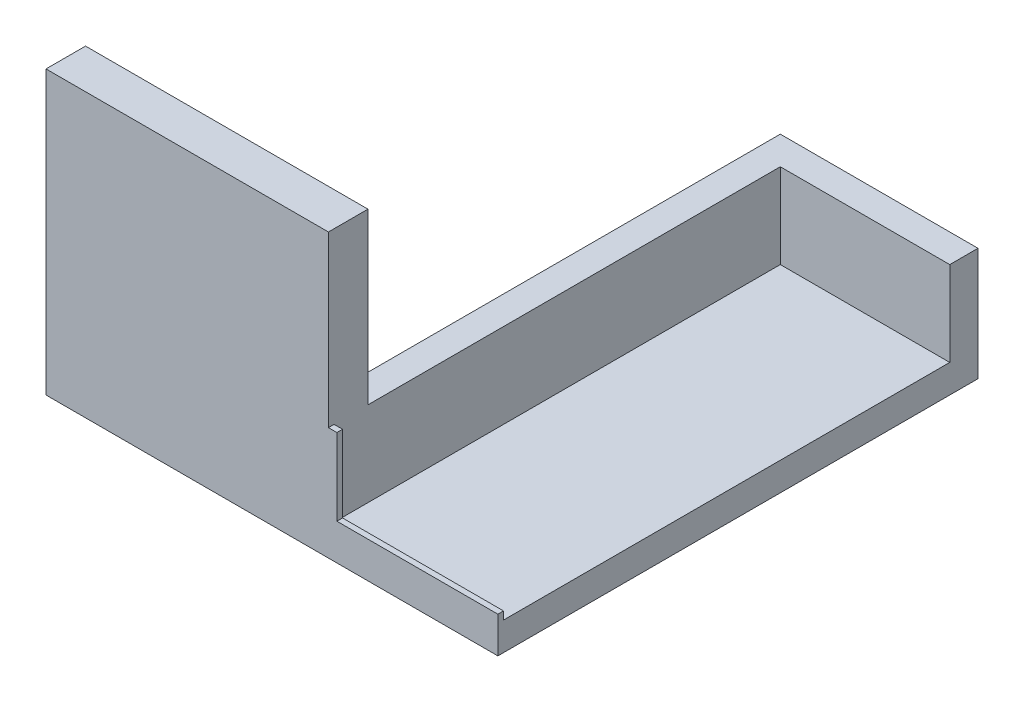
ISO-10303-21;
HEADER;
FILE_DESCRIPTION(('STEP AP214'),'2;1');
FILE_NAME('part.step','',(''),(''),'','','');
FILE_SCHEMA(('AUTOMOTIVE_DESIGN { 1 0 10303 214 1 1 1 1 }'));
ENDSEC;
DATA;
#1=APPLICATION_CONTEXT('core data for automotive mechanical design processes');
#2=APPLICATION_PROTOCOL_DEFINITION('international standard','automotive_design',2000,#1);
#3=PRODUCT_CONTEXT('',#1,'mechanical');
#4=PRODUCT('Part','Part','',(#3));
#5=PRODUCT_RELATED_PRODUCT_CATEGORY('part','',(#4));
#6=PRODUCT_DEFINITION_FORMATION('','',#4);
#7=PRODUCT_DEFINITION_CONTEXT('part definition',#1,'design');
#8=PRODUCT_DEFINITION('design','',#6,#7);
#9=PRODUCT_DEFINITION_SHAPE('','',#8);
#10=(LENGTH_UNIT() NAMED_UNIT(*) SI_UNIT(.MILLI.,.METRE.));
#11=(NAMED_UNIT(*) PLANE_ANGLE_UNIT() SI_UNIT($,.RADIAN.));
#12=(NAMED_UNIT(*) SI_UNIT($,.STERADIAN.) SOLID_ANGLE_UNIT());
#13=UNCERTAINTY_MEASURE_WITH_UNIT(LENGTH_MEASURE(1.E-05),#10,'distance_accuracy_value','');
#14=(GEOMETRIC_REPRESENTATION_CONTEXT(3) GLOBAL_UNCERTAINTY_ASSIGNED_CONTEXT((#13)) GLOBAL_UNIT_ASSIGNED_CONTEXT((#10,
#11,#12)) REPRESENTATION_CONTEXT('',''));
#15=CARTESIAN_POINT('',(0.,0.,0.));
#16=DIRECTION('',(0.,0.,1.));
#17=DIRECTION('',(1.,0.,0.));
#18=AXIS2_PLACEMENT_3D('',#15,#16,#17);
#19=CARTESIAN_POINT('',(0.,5.,0.));
#20=DIRECTION('',(0.,1.,0.));
#21=DIRECTION('',(0.,0.,1.));
#22=AXIS2_PLACEMENT_3D('',#19,#20,#21);
#23=PLANE('',#22);
#24=DIRECTION('',(0.,0.,1.));
#25=VECTOR('',#24,1.);
#26=CARTESIAN_POINT('',(-30.,5.,0.));
#27=LINE('',#26,#25);
#28=CARTESIAN_POINT('',(-30.,5.,-80.));
#29=VERTEX_POINT('',#28);
#30=CARTESIAN_POINT('',(-30.,5.,-1.));
#31=VERTEX_POINT('',#30);
#32=EDGE_CURVE('E74',#29,#31,#27,.T.);
#33=ORIENTED_EDGE('',*,*,#32,.T.);
#34=DIRECTION('',(-1.,0.,0.));
#35=VECTOR('',#34,1.);
#36=CARTESIAN_POINT('',(0.,5.,-1.));
#37=LINE('',#36,#35);
#38=CARTESIAN_POINT('',(0.,5.,-1.));
#39=VERTEX_POINT('',#38);
#40=EDGE_CURVE('E89',#39,#31,#37,.T.);
#41=ORIENTED_EDGE('',*,*,#40,.F.);
#42=DIRECTION('',(0.,0.,1.));
#43=VECTOR('',#42,1.);
#44=CARTESIAN_POINT('',(0.,5.,0.));
#45=LINE('',#44,#43);
#46=CARTESIAN_POINT('',(0.,5.,-80.));
#47=VERTEX_POINT('',#46);
#48=EDGE_CURVE('E300',#47,#39,#45,.T.);
#49=ORIENTED_EDGE('',*,*,#48,.F.);
#50=DIRECTION('',(1.,0.,0.));
#51=VECTOR('',#50,1.);
#52=CARTESIAN_POINT('',(0.,5.,-80.));
#53=LINE('',#52,#51);
#54=EDGE_CURVE('E304',#29,#47,#53,.T.);
#55=ORIENTED_EDGE('',*,*,#54,.F.);
#56=EDGE_LOOP('',(#33,#41,#49,#55));
#57=FACE_BOUND('',#56,.T.);
#58=ADVANCED_FACE('F65',(#57),#23,.T.);
#59=CARTESIAN_POINT('',(-30.,20.,0.));
#60=DIRECTION('',(1.,0.,0.));
#61=DIRECTION('',(0.,0.,-1.));
#62=AXIS2_PLACEMENT_3D('',#59,#60,#61);
#63=PLANE('',#62);
#64=DIRECTION('',(0.,0.,1.));
#65=VECTOR('',#64,1.);
#66=CARTESIAN_POINT('',(-30.,20.,0.));
#67=LINE('',#66,#65);
#68=CARTESIAN_POINT('',(-30.,20.,-1.));
#69=VERTEX_POINT('',#68);
#70=CARTESIAN_POINT('',(-30.,20.,0.));
#71=VERTEX_POINT('',#70);
#72=EDGE_CURVE('E81',#69,#71,#67,.T.);
#73=ORIENTED_EDGE('',*,*,#72,.F.);
#74=DIRECTION('',(0.,-1.,0.));
#75=VECTOR('',#74,1.);
#76=CARTESIAN_POINT('',(-30.,20.,-1.));
#77=LINE('',#76,#75);
#78=EDGE_CURVE('E197',#69,#31,#77,.T.);
#79=ORIENTED_EDGE('',*,*,#78,.T.);
#80=ORIENTED_EDGE('',*,*,#32,.F.);
#81=DIRECTION('',(0.,-1.,0.));
#82=VECTOR('',#81,1.);
#83=CARTESIAN_POINT('',(-30.,20.,-80.));
#84=LINE('',#83,#82);
#85=CARTESIAN_POINT('',(-30.,20.,-80.));
#86=VERTEX_POINT('',#85);
#87=EDGE_CURVE('E281',#86,#29,#84,.T.);
#88=ORIENTED_EDGE('',*,*,#87,.F.);
#89=DIRECTION('',(0.,0.,1.));
#90=VECTOR('',#89,1.);
#91=CARTESIAN_POINT('',(-30.,20.,0.));
#92=LINE('',#91,#90);
#93=CARTESIAN_POINT('',(-30.,20.,-7.00000000000001));
#94=VERTEX_POINT('',#93);
#95=EDGE_CURVE('E252',#86,#94,#92,.T.);
#96=ORIENTED_EDGE('',*,*,#95,.T.);
#97=DIRECTION('',(0.,-1.,0.));
#98=VECTOR('',#97,1.);
#99=CARTESIAN_POINT('',(-30.,50.,-7.00000000000001));
#100=LINE('',#99,#98);
#101=CARTESIAN_POINT('',(-30.,50.,-7.00000000000001));
#102=VERTEX_POINT('',#101);
#103=EDGE_CURVE('E231',#102,#94,#100,.T.);
#104=ORIENTED_EDGE('',*,*,#103,.F.);
#105=DIRECTION('',(0.,0.,1.));
#106=VECTOR('',#105,1.);
#107=CARTESIAN_POINT('',(-30.,50.,0.));
#108=LINE('',#107,#106);
#109=CARTESIAN_POINT('',(-30.,50.,0.));
#110=VERTEX_POINT('',#109);
#111=EDGE_CURVE('E227',#102,#110,#108,.T.);
#112=ORIENTED_EDGE('',*,*,#111,.T.);
#113=DIRECTION('',(0.,-1.,0.));
#114=VECTOR('',#113,1.);
#115=CARTESIAN_POINT('',(-30.,50.,0.));
#116=LINE('',#115,#114);
#117=EDGE_CURVE('E240',#110,#71,#116,.T.);
#118=ORIENTED_EDGE('',*,*,#117,.T.);
#119=EDGE_LOOP('',(#73,#79,#80,#88,#96,#104,#112,#118));
#120=FACE_BOUND('',#119,.T.);
#121=ADVANCED_FACE('F334',(#120),#63,.T.);
#122=CARTESIAN_POINT('',(0.,5.,0.));
#123=DIRECTION('',(1.,0.,0.));
#124=DIRECTION('',(0.,0.,-1.));
#125=AXIS2_PLACEMENT_3D('',#122,#123,#124);
#126=PLANE('',#125);
#127=DIRECTION('',(0.,0.,1.));
#128=VECTOR('',#127,1.);
#129=CARTESIAN_POINT('',(0.,0.,0.));
#130=LINE('',#129,#128);
#131=CARTESIAN_POINT('',(0.,0.,-85.));
#132=VERTEX_POINT('',#131);
#133=CARTESIAN_POINT('',(0.,0.,0.));
#134=VERTEX_POINT('',#133);
#135=EDGE_CURVE('E299',#132,#134,#130,.T.);
#136=ORIENTED_EDGE('',*,*,#135,.F.);
#137=DIRECTION('',(0.,-1.,0.));
#138=VECTOR('',#137,1.);
#139=CARTESIAN_POINT('',(0.,20.,-85.));
#140=LINE('',#139,#138);
#141=CARTESIAN_POINT('',(0.,20.,-85.));
#142=VERTEX_POINT('',#141);
#143=EDGE_CURVE('E289',#142,#132,#140,.T.);
#144=ORIENTED_EDGE('',*,*,#143,.F.);
#145=DIRECTION('',(0.,0.,-1.));
#146=VECTOR('',#145,1.);
#147=CARTESIAN_POINT('',(0.,20.,-80.));
#148=LINE('',#147,#146);
#149=CARTESIAN_POINT('',(0.,20.,-80.));
#150=VERTEX_POINT('',#149);
#151=EDGE_CURVE('E285',#150,#142,#148,.T.);
#152=ORIENTED_EDGE('',*,*,#151,.F.);
#153=DIRECTION('',(0.,-1.,0.));
#154=VECTOR('',#153,1.);
#155=CARTESIAN_POINT('',(0.,20.,-80.));
#156=LINE('',#155,#154);
#157=EDGE_CURVE('E271',#150,#47,#156,.T.);
#158=ORIENTED_EDGE('',*,*,#157,.T.);
#159=ORIENTED_EDGE('',*,*,#48,.T.);
#160=DIRECTION('',(0.,-1.,0.));
#161=VECTOR('',#160,1.);
#162=CARTESIAN_POINT('',(0.,6.4,-1.));
#163=LINE('',#162,#161);
#164=CARTESIAN_POINT('',(0.,6.4,-1.));
#165=VERTEX_POINT('',#164);
#166=EDGE_CURVE('E210',#165,#39,#163,.T.);
#167=ORIENTED_EDGE('',*,*,#166,.F.);
#168=DIRECTION('',(0.,0.,-1.));
#169=VECTOR('',#168,1.);
#170=CARTESIAN_POINT('',(0.,6.4,0.));
#171=LINE('',#170,#169);
#172=CARTESIAN_POINT('',(0.,6.4,0.));
#173=VERTEX_POINT('',#172);
#174=EDGE_CURVE('E205',#173,#165,#171,.T.);
#175=ORIENTED_EDGE('',*,*,#174,.F.);
#176=DIRECTION('',(0.,-1.,0.));
#177=VECTOR('',#176,1.);
#178=CARTESIAN_POINT('',(0.,5.,0.));
#179=LINE('',#178,#177);
#180=EDGE_CURVE('E12',#173,#134,#179,.T.);
#181=ORIENTED_EDGE('',*,*,#180,.T.);
#182=EDGE_LOOP('',(#136,#144,#152,#158,#159,#167,#175,#181));
#183=FACE_BOUND('',#182,.T.);
#184=ADVANCED_FACE('F67',(#183),#126,.T.);
#185=CARTESIAN_POINT('',(0.,5.,0.));
#186=DIRECTION('',(0.,0.,-1.));
#187=DIRECTION('',(-1.,0.,0.));
#188=AXIS2_PLACEMENT_3D('',#185,#186,#187);
#189=PLANE('',#188);
#190=DIRECTION('',(1.,0.,0.));
#191=VECTOR('',#190,1.);
#192=CARTESIAN_POINT('',(0.,0.,0.));
#193=LINE('',#192,#191);
#194=CARTESIAN_POINT('',(-80.,0.,0.));
#195=VERTEX_POINT('',#194);
#196=EDGE_CURVE('E305',#195,#134,#193,.T.);
#197=ORIENTED_EDGE('',*,*,#196,.T.);
#198=ORIENTED_EDGE('',*,*,#180,.F.);
#199=DIRECTION('',(1.,0.,0.));
#200=VECTOR('',#199,1.);
#201=CARTESIAN_POINT('',(0.,6.4,0.));
#202=LINE('',#201,#200);
#203=CARTESIAN_POINT('',(-28.5,6.4,0.));
#204=VERTEX_POINT('',#203);
#205=EDGE_CURVE('E189',#204,#173,#202,.T.);
#206=ORIENTED_EDGE('',*,*,#205,.F.);
#207=DIRECTION('',(0.,-1.,0.));
#208=VECTOR('',#207,1.);
#209=CARTESIAN_POINT('',(-28.5,20.,0.));
#210=LINE('',#209,#208);
#211=CARTESIAN_POINT('',(-28.5,20.,0.));
#212=VERTEX_POINT('',#211);
#213=EDGE_CURVE('E172',#212,#204,#210,.T.);
#214=ORIENTED_EDGE('',*,*,#213,.F.);
#215=DIRECTION('',(1.,0.,0.));
#216=VECTOR('',#215,1.);
#217=CARTESIAN_POINT('',(0.,20.,0.));
#218=LINE('',#217,#216);
#219=EDGE_CURVE('E179',#71,#212,#218,.T.);
#220=ORIENTED_EDGE('',*,*,#219,.F.);
#221=ORIENTED_EDGE('',*,*,#117,.F.);
#222=DIRECTION('',(-1.,0.,0.));
#223=VECTOR('',#222,1.);
#224=CARTESIAN_POINT('',(0.,50.,0.));
#225=LINE('',#224,#223);
#226=CARTESIAN_POINT('',(-80.,50.,0.));
#227=VERTEX_POINT('',#226);
#228=EDGE_CURVE('E223',#110,#227,#225,.T.);
#229=ORIENTED_EDGE('',*,*,#228,.T.);
#230=DIRECTION('',(0.,-1.,0.));
#231=VECTOR('',#230,1.);
#232=CARTESIAN_POINT('',(-80.,50.,0.));
#233=LINE('',#232,#231);
#234=EDGE_CURVE('E243',#227,#195,#233,.T.);
#235=ORIENTED_EDGE('',*,*,#234,.T.);
#236=EDGE_LOOP('',(#197,#198,#206,#214,#220,#221,#229,#235));
#237=FACE_BOUND('',#236,.T.);
#238=ADVANCED_FACE('F187',(#237),#189,.F.);
#239=CARTESIAN_POINT('',(0.,0.,0.));
#240=DIRECTION('',(0.,1.,0.));
#241=DIRECTION('',(0.,0.,1.));
#242=AXIS2_PLACEMENT_3D('',#239,#240,#241);
#243=PLANE('',#242);
#244=ORIENTED_EDGE('',*,*,#196,.F.);
#245=DIRECTION('',(0.,0.,1.));
#246=VECTOR('',#245,1.);
#247=CARTESIAN_POINT('',(-80.,0.,1.58603289232165E-13));
#248=LINE('',#247,#246);
#249=CARTESIAN_POINT('',(-80.,0.,-7.00000000000001));
#250=VERTEX_POINT('',#249);
#251=EDGE_CURVE('E220',#250,#195,#248,.T.);
#252=ORIENTED_EDGE('',*,*,#251,.F.);
#253=DIRECTION('',(-1.,0.,0.));
#254=VECTOR('',#253,1.);
#255=CARTESIAN_POINT('',(0.,0.,-7.00000000000001));
#256=LINE('',#255,#254);
#257=CARTESIAN_POINT('',(-35.,0.,-7.00000000000001));
#258=VERTEX_POINT('',#257);
#259=EDGE_CURVE('E214',#258,#250,#256,.T.);
#260=ORIENTED_EDGE('',*,*,#259,.F.);
#261=DIRECTION('',(0.,0.,1.));
#262=VECTOR('',#261,1.);
#263=CARTESIAN_POINT('',(-35.,0.,0.));
#264=LINE('',#263,#262);
#265=CARTESIAN_POINT('',(-35.,0.,-85.));
#266=VERTEX_POINT('',#265);
#267=EDGE_CURVE('E256',#266,#258,#264,.T.);
#268=ORIENTED_EDGE('',*,*,#267,.F.);
#269=DIRECTION('',(-1.,0.,0.));
#270=VECTOR('',#269,1.);
#271=CARTESIAN_POINT('',(0.,0.,-85.));
#272=LINE('',#271,#270);
#273=EDGE_CURVE('E268',#132,#266,#272,.T.);
#274=ORIENTED_EDGE('',*,*,#273,.F.);
#275=ORIENTED_EDGE('',*,*,#135,.T.);
#276=EDGE_LOOP('',(#244,#252,#260,#268,#274,#275));
#277=FACE_BOUND('',#276,.T.);
#278=ADVANCED_FACE('F318',(#277),#243,.F.);
#279=CARTESIAN_POINT('',(0.,20.,-85.));
#280=DIRECTION('',(0.,0.,1.));
#281=DIRECTION('',(1.,0.,0.));
#282=AXIS2_PLACEMENT_3D('',#279,#280,#281);
#283=PLANE('',#282);
#284=ORIENTED_EDGE('',*,*,#273,.T.);
#285=DIRECTION('',(0.,-1.,0.));
#286=VECTOR('',#285,1.);
#287=CARTESIAN_POINT('',(-35.,20.,-85.));
#288=LINE('',#287,#286);
#289=CARTESIAN_POINT('',(-35.,20.,-85.));
#290=VERTEX_POINT('',#289);
#291=EDGE_CURVE('E277',#290,#266,#288,.T.);
#292=ORIENTED_EDGE('',*,*,#291,.F.);
#293=DIRECTION('',(-1.,0.,0.));
#294=VECTOR('',#293,1.);
#295=CARTESIAN_POINT('',(0.,20.,-85.));
#296=LINE('',#295,#294);
#297=EDGE_CURVE('E255',#142,#290,#296,.T.);
#298=ORIENTED_EDGE('',*,*,#297,.F.);
#299=ORIENTED_EDGE('',*,*,#143,.T.);
#300=EDGE_LOOP('',(#284,#292,#298,#299));
#301=FACE_BOUND('',#300,.T.);
#302=ADVANCED_FACE('F361',(#301),#283,.F.);
#303=CARTESIAN_POINT('',(-35.,20.,0.));
#304=DIRECTION('',(1.,0.,0.));
#305=DIRECTION('',(0.,0.,-1.));
#306=AXIS2_PLACEMENT_3D('',#303,#304,#305);
#307=PLANE('',#306);
#308=DIRECTION('',(0.,-1.,0.));
#309=VECTOR('',#308,1.);
#310=CARTESIAN_POINT('',(-35.,20.,-7.00000000000001));
#311=LINE('',#310,#309);
#312=CARTESIAN_POINT('',(-35.,20.,-7.00000000000001));
#313=VERTEX_POINT('',#312);
#314=EDGE_CURVE('E267',#313,#258,#311,.T.);
#315=ORIENTED_EDGE('',*,*,#314,.F.);
#316=DIRECTION('',(0.,0.,1.));
#317=VECTOR('',#316,1.);
#318=CARTESIAN_POINT('',(-35.,20.,0.));
#319=LINE('',#318,#317);
#320=EDGE_CURVE('E259',#290,#313,#319,.T.);
#321=ORIENTED_EDGE('',*,*,#320,.F.);
#322=ORIENTED_EDGE('',*,*,#291,.T.);
#323=ORIENTED_EDGE('',*,*,#267,.T.);
#324=EDGE_LOOP('',(#315,#321,#322,#323));
#325=FACE_BOUND('',#324,.T.);
#326=ADVANCED_FACE('F358',(#325),#307,.F.);
#327=CARTESIAN_POINT('',(0.,20.,0.));
#328=DIRECTION('',(0.,1.,0.));
#329=DIRECTION('',(0.,0.,1.));
#330=AXIS2_PLACEMENT_3D('',#327,#328,#329);
#331=PLANE('',#330);
#332=ORIENTED_EDGE('',*,*,#95,.F.);
#333=DIRECTION('',(-1.,0.,0.));
#334=VECTOR('',#333,1.);
#335=CARTESIAN_POINT('',(0.,20.,-80.));
#336=LINE('',#335,#334);
#337=EDGE_CURVE('E251',#150,#86,#336,.T.);
#338=ORIENTED_EDGE('',*,*,#337,.F.);
#339=ORIENTED_EDGE('',*,*,#151,.T.);
#340=ORIENTED_EDGE('',*,*,#297,.T.);
#341=ORIENTED_EDGE('',*,*,#320,.T.);
#342=DIRECTION('',(-1.,0.,0.));
#343=VECTOR('',#342,1.);
#344=CARTESIAN_POINT('',(0.,20.,-7.00000000000001));
#345=LINE('',#344,#343);
#346=EDGE_CURVE('E263',#94,#313,#345,.T.);
#347=ORIENTED_EDGE('',*,*,#346,.F.);
#348=EDGE_LOOP('',(#332,#338,#339,#340,#341,#347));
#349=FACE_BOUND('',#348,.T.);
#350=ADVANCED_FACE('F343',(#349),#331,.T.);
#351=CARTESIAN_POINT('',(0.,20.,-80.));
#352=DIRECTION('',(0.,0.,1.));
#353=DIRECTION('',(1.,0.,0.));
#354=AXIS2_PLACEMENT_3D('',#351,#352,#353);
#355=PLANE('',#354);
#356=ORIENTED_EDGE('',*,*,#87,.T.);
#357=ORIENTED_EDGE('',*,*,#54,.T.);
#358=ORIENTED_EDGE('',*,*,#157,.F.);
#359=ORIENTED_EDGE('',*,*,#337,.T.);
#360=EDGE_LOOP('',(#356,#357,#358,#359));
#361=FACE_BOUND('',#360,.T.);
#362=ADVANCED_FACE('F339',(#361),#355,.T.);
#363=CARTESIAN_POINT('',(0.,50.,-7.00000000000001));
#364=DIRECTION('',(0.,0.,1.));
#365=DIRECTION('',(1.,0.,0.));
#366=AXIS2_PLACEMENT_3D('',#363,#364,#365);
#367=PLANE('',#366);
#368=ORIENTED_EDGE('',*,*,#346,.T.);
#369=ORIENTED_EDGE('',*,*,#314,.T.);
#370=ORIENTED_EDGE('',*,*,#259,.T.);
#371=DIRECTION('',(0.,-1.,0.));
#372=VECTOR('',#371,1.);
#373=CARTESIAN_POINT('',(-80.,50.,-7.00000000000001));
#374=LINE('',#373,#372);
#375=CARTESIAN_POINT('',(-80.,50.,-7.00000000000001));
#376=VERTEX_POINT('',#375);
#377=EDGE_CURVE('E247',#376,#250,#374,.T.);
#378=ORIENTED_EDGE('',*,*,#377,.F.);
#379=DIRECTION('',(-1.,0.,0.));
#380=VECTOR('',#379,1.);
#381=CARTESIAN_POINT('',(0.,50.,-7.00000000000001));
#382=LINE('',#381,#380);
#383=EDGE_CURVE('E215',#102,#376,#382,.T.);
#384=ORIENTED_EDGE('',*,*,#383,.F.);
#385=ORIENTED_EDGE('',*,*,#103,.T.);
#386=EDGE_LOOP('',(#368,#369,#370,#378,#384,#385));
#387=FACE_BOUND('',#386,.T.);
#388=ADVANCED_FACE('F349',(#387),#367,.F.);
#389=CARTESIAN_POINT('',(-80.,50.,1.58603289232165E-13));
#390=DIRECTION('',(1.,0.,0.));
#391=DIRECTION('',(0.,0.,-1.));
#392=AXIS2_PLACEMENT_3D('',#389,#390,#391);
#393=PLANE('',#392);
#394=ORIENTED_EDGE('',*,*,#251,.T.);
#395=ORIENTED_EDGE('',*,*,#234,.F.);
#396=DIRECTION('',(0.,0.,1.));
#397=VECTOR('',#396,1.);
#398=CARTESIAN_POINT('',(-80.,50.,1.58603289232165E-13));
#399=LINE('',#398,#397);
#400=EDGE_CURVE('E219',#376,#227,#399,.T.);
#401=ORIENTED_EDGE('',*,*,#400,.F.);
#402=ORIENTED_EDGE('',*,*,#377,.T.);
#403=EDGE_LOOP('',(#394,#395,#401,#402));
#404=FACE_BOUND('',#403,.T.);
#405=ADVANCED_FACE('F354',(#404),#393,.F.);
#406=CARTESIAN_POINT('',(0.,50.,0.));
#407=DIRECTION('',(0.,1.,0.));
#408=DIRECTION('',(0.,0.,1.));
#409=AXIS2_PLACEMENT_3D('',#406,#407,#408);
#410=PLANE('',#409);
#411=ORIENTED_EDGE('',*,*,#383,.T.);
#412=ORIENTED_EDGE('',*,*,#400,.T.);
#413=ORIENTED_EDGE('',*,*,#228,.F.);
#414=ORIENTED_EDGE('',*,*,#111,.F.);
#415=EDGE_LOOP('',(#411,#412,#413,#414));
#416=FACE_BOUND('',#415,.T.);
#417=ADVANCED_FACE('F352',(#416),#410,.T.);
#418=CARTESIAN_POINT('',(0.,6.4,-1.));
#419=DIRECTION('',(0.,0.,1.));
#420=DIRECTION('',(1.,0.,0.));
#421=AXIS2_PLACEMENT_3D('',#418,#419,#420);
#422=PLANE('',#421);
#423=ORIENTED_EDGE('',*,*,#40,.T.);
#424=ORIENTED_EDGE('',*,*,#78,.F.);
#425=DIRECTION('',(-1.,0.,0.));
#426=VECTOR('',#425,1.);
#427=CARTESIAN_POINT('',(0.,20.,-1.));
#428=LINE('',#427,#426);
#429=CARTESIAN_POINT('',(-28.5,20.,-1.));
#430=VERTEX_POINT('',#429);
#431=EDGE_CURVE('E178',#430,#69,#428,.T.);
#432=ORIENTED_EDGE('',*,*,#431,.F.);
#433=DIRECTION('',(0.,-1.,0.));
#434=VECTOR('',#433,1.);
#435=CARTESIAN_POINT('',(-28.5,20.,-1.));
#436=LINE('',#435,#434);
#437=CARTESIAN_POINT('',(-28.5,6.4,-1.));
#438=VERTEX_POINT('',#437);
#439=EDGE_CURVE('E174',#430,#438,#436,.T.);
#440=ORIENTED_EDGE('',*,*,#439,.T.);
#441=DIRECTION('',(-1.,0.,0.));
#442=VECTOR('',#441,1.);
#443=CARTESIAN_POINT('',(0.,6.4,-1.));
#444=LINE('',#443,#442);
#445=EDGE_CURVE('E208',#165,#438,#444,.T.);
#446=ORIENTED_EDGE('',*,*,#445,.F.);
#447=ORIENTED_EDGE('',*,*,#166,.T.);
#448=EDGE_LOOP('',(#423,#424,#432,#440,#446,#447));
#449=FACE_BOUND('',#448,.T.);
#450=ADVANCED_FACE('F328',(#449),#422,.F.);
#451=CARTESIAN_POINT('',(0.,6.4,0.));
#452=DIRECTION('',(0.,1.,0.));
#453=DIRECTION('',(0.,0.,1.));
#454=AXIS2_PLACEMENT_3D('',#451,#452,#453);
#455=PLANE('',#454);
#456=DIRECTION('',(0.,0.,-1.));
#457=VECTOR('',#456,1.);
#458=CARTESIAN_POINT('',(-28.5,6.4,0.));
#459=LINE('',#458,#457);
#460=EDGE_CURVE('E195',#204,#438,#459,.T.);
#461=ORIENTED_EDGE('',*,*,#460,.F.);
#462=ORIENTED_EDGE('',*,*,#205,.T.);
#463=ORIENTED_EDGE('',*,*,#174,.T.);
#464=ORIENTED_EDGE('',*,*,#445,.T.);
#465=EDGE_LOOP('',(#461,#462,#463,#464));
#466=FACE_BOUND('',#465,.T.);
#467=ADVANCED_FACE('F327',(#466),#455,.T.);
#468=CARTESIAN_POINT('',(-28.5,20.,0.));
#469=DIRECTION('',(-1.,0.,0.));
#470=DIRECTION('',(0.,0.,1.));
#471=AXIS2_PLACEMENT_3D('',#468,#469,#470);
#472=PLANE('',#471);
#473=ORIENTED_EDGE('',*,*,#460,.T.);
#474=ORIENTED_EDGE('',*,*,#439,.F.);
#475=DIRECTION('',(0.,0.,-1.));
#476=VECTOR('',#475,1.);
#477=CARTESIAN_POINT('',(-28.5,20.,0.));
#478=LINE('',#477,#476);
#479=EDGE_CURVE('E167',#212,#430,#478,.T.);
#480=ORIENTED_EDGE('',*,*,#479,.F.);
#481=ORIENTED_EDGE('',*,*,#213,.T.);
#482=EDGE_LOOP('',(#473,#474,#480,#481));
#483=FACE_BOUND('',#482,.T.);
#484=ADVANCED_FACE('F170',(#483),#472,.F.);
#485=CARTESIAN_POINT('',(0.,20.,0.));
#486=DIRECTION('',(0.,1.,0.));
#487=DIRECTION('',(0.,0.,1.));
#488=AXIS2_PLACEMENT_3D('',#485,#486,#487);
#489=PLANE('',#488);
#490=ORIENTED_EDGE('',*,*,#219,.T.);
#491=ORIENTED_EDGE('',*,*,#479,.T.);
#492=ORIENTED_EDGE('',*,*,#431,.T.);
#493=ORIENTED_EDGE('',*,*,#72,.T.);
#494=EDGE_LOOP('',(#490,#491,#492,#493));
#495=FACE_BOUND('',#494,.T.);
#496=ADVANCED_FACE('F182',(#495),#489,.T.);
#497=CLOSED_SHELL('',(#58,#121,#184,#238,#278,#302,#326,#350,#362,#388,#405,#417,#450,#467,#484,#496));
#498=MANIFOLD_SOLID_BREP('B2',#497);
#499=ADVANCED_BREP_SHAPE_REPRESENTATION('',(#18,#498),#14);
#500=SHAPE_DEFINITION_REPRESENTATION(#9,#499);
ENDSEC;
END-ISO-10303-21;
